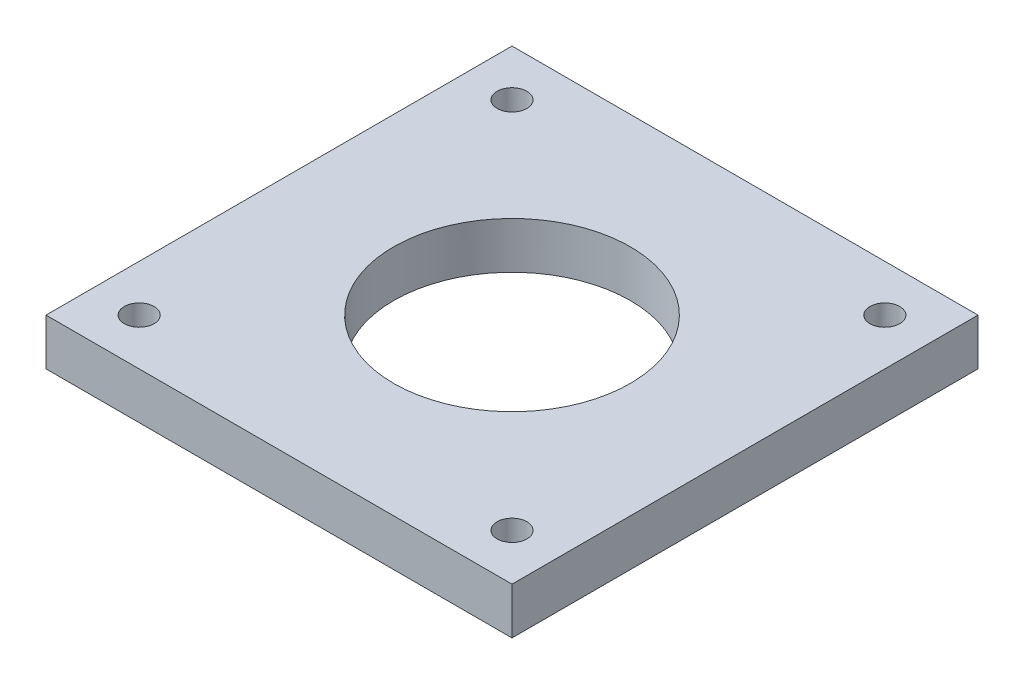
ISO-10303-21;
HEADER;
FILE_DESCRIPTION(('STEP AP214'),'2;1');
FILE_NAME('part.step','',(''),(''),'','','');
FILE_SCHEMA(('AUTOMOTIVE_DESIGN { 1 0 10303 214 1 1 1 1 }'));
ENDSEC;
DATA;
#1=APPLICATION_CONTEXT('core data for automotive mechanical design processes');
#2=APPLICATION_PROTOCOL_DEFINITION('international standard','automotive_design',2000,#1);
#3=PRODUCT_CONTEXT('',#1,'mechanical');
#4=PRODUCT('Part','Part','',(#3));
#5=PRODUCT_RELATED_PRODUCT_CATEGORY('part','',(#4));
#6=PRODUCT_DEFINITION_FORMATION('','',#4);
#7=PRODUCT_DEFINITION_CONTEXT('part definition',#1,'design');
#8=PRODUCT_DEFINITION('design','',#6,#7);
#9=PRODUCT_DEFINITION_SHAPE('','',#8);
#10=(LENGTH_UNIT() NAMED_UNIT(*) SI_UNIT(.MILLI.,.METRE.));
#11=(NAMED_UNIT(*) PLANE_ANGLE_UNIT() SI_UNIT($,.RADIAN.));
#12=(NAMED_UNIT(*) SI_UNIT($,.STERADIAN.) SOLID_ANGLE_UNIT());
#13=UNCERTAINTY_MEASURE_WITH_UNIT(LENGTH_MEASURE(1.E-05),#10,'distance_accuracy_value','');
#14=(GEOMETRIC_REPRESENTATION_CONTEXT(3) GLOBAL_UNCERTAINTY_ASSIGNED_CONTEXT((#13)) GLOBAL_UNIT_ASSIGNED_CONTEXT((#10,
#11,#12)) REPRESENTATION_CONTEXT('',''));
#15=CARTESIAN_POINT('',(0.,0.,0.));
#16=DIRECTION('',(0.,0.,1.));
#17=DIRECTION('',(1.,0.,0.));
#18=AXIS2_PLACEMENT_3D('',#15,#16,#17);
#19=CARTESIAN_POINT('',(25.,5.,25.));
#20=DIRECTION('',(-1.,0.,0.));
#21=DIRECTION('',(0.,0.,1.));
#22=AXIS2_PLACEMENT_3D('',#19,#20,#21);
#23=PLANE('',#22);
#24=DIRECTION('',(0.,0.,-1.));
#25=VECTOR('',#24,1.);
#26=CARTESIAN_POINT('',(25.,0.,25.));
#27=LINE('',#26,#25);
#28=CARTESIAN_POINT('',(25.,0.,25.));
#29=VERTEX_POINT('',#28);
#30=CARTESIAN_POINT('',(25.,0.,-25.));
#31=VERTEX_POINT('',#30);
#32=EDGE_CURVE('E97',#29,#31,#27,.T.);
#33=ORIENTED_EDGE('',*,*,#32,.T.);
#34=DIRECTION('',(0.,-1.,0.));
#35=VECTOR('',#34,1.);
#36=CARTESIAN_POINT('',(25.,5.,-25.));
#37=LINE('',#36,#35);
#38=CARTESIAN_POINT('',(25.,5.,-25.));
#39=VERTEX_POINT('',#38);
#40=EDGE_CURVE('E11',#39,#31,#37,.T.);
#41=ORIENTED_EDGE('',*,*,#40,.F.);
#42=DIRECTION('',(0.,0.,-1.));
#43=VECTOR('',#42,1.);
#44=CARTESIAN_POINT('',(25.,5.,25.));
#45=LINE('',#44,#43);
#46=CARTESIAN_POINT('',(25.,5.,25.));
#47=VERTEX_POINT('',#46);
#48=EDGE_CURVE('E84',#47,#39,#45,.T.);
#49=ORIENTED_EDGE('',*,*,#48,.F.);
#50=DIRECTION('',(0.,-1.,0.));
#51=VECTOR('',#50,1.);
#52=CARTESIAN_POINT('',(25.,5.,25.));
#53=LINE('',#52,#51);
#54=EDGE_CURVE('E93',#47,#29,#53,.T.);
#55=ORIENTED_EDGE('',*,*,#54,.T.);
#56=EDGE_LOOP('',(#33,#41,#49,#55));
#57=FACE_BOUND('',#56,.T.);
#58=ADVANCED_FACE('F31',(#57),#23,.F.);
#59=CARTESIAN_POINT('',(-25.,5.,-25.));
#60=DIRECTION('',(0.,0.,1.));
#61=DIRECTION('',(1.,0.,0.));
#62=AXIS2_PLACEMENT_3D('',#59,#60,#61);
#63=PLANE('',#62);
#64=DIRECTION('',(-1.,0.,0.));
#65=VECTOR('',#64,1.);
#66=CARTESIAN_POINT('',(-25.,0.,-25.));
#67=LINE('',#66,#65);
#68=CARTESIAN_POINT('',(-25.,0.,-25.));
#69=VERTEX_POINT('',#68);
#70=EDGE_CURVE('E88',#31,#69,#67,.T.);
#71=ORIENTED_EDGE('',*,*,#70,.T.);
#72=DIRECTION('',(0.,-1.,0.));
#73=VECTOR('',#72,1.);
#74=CARTESIAN_POINT('',(-25.,5.,-25.));
#75=LINE('',#74,#73);
#76=CARTESIAN_POINT('',(-25.,5.,-25.));
#77=VERTEX_POINT('',#76);
#78=EDGE_CURVE('E40',#77,#69,#75,.T.);
#79=ORIENTED_EDGE('',*,*,#78,.F.);
#80=DIRECTION('',(-1.,0.,0.));
#81=VECTOR('',#80,1.);
#82=CARTESIAN_POINT('',(-25.,5.,-25.));
#83=LINE('',#82,#81);
#84=EDGE_CURVE('E79',#39,#77,#83,.T.);
#85=ORIENTED_EDGE('',*,*,#84,.F.);
#86=ORIENTED_EDGE('',*,*,#40,.T.);
#87=EDGE_LOOP('',(#71,#79,#85,#86));
#88=FACE_BOUND('',#87,.T.);
#89=ADVANCED_FACE('F87',(#88),#63,.F.);
#90=CARTESIAN_POINT('',(-25.,5.,25.));
#91=DIRECTION('',(1.,0.,0.));
#92=DIRECTION('',(0.,0.,-1.));
#93=AXIS2_PLACEMENT_3D('',#90,#91,#92);
#94=PLANE('',#93);
#95=DIRECTION('',(0.,0.,1.));
#96=VECTOR('',#95,1.);
#97=CARTESIAN_POINT('',(-25.,0.,25.));
#98=LINE('',#97,#96);
#99=CARTESIAN_POINT('',(-25.,0.,25.));
#100=VERTEX_POINT('',#99);
#101=EDGE_CURVE('E66',#69,#100,#98,.T.);
#102=ORIENTED_EDGE('',*,*,#101,.T.);
#103=DIRECTION('',(0.,-1.,0.));
#104=VECTOR('',#103,1.);
#105=CARTESIAN_POINT('',(-25.,5.,25.));
#106=LINE('',#105,#104);
#107=CARTESIAN_POINT('',(-25.,5.,25.));
#108=VERTEX_POINT('',#107);
#109=EDGE_CURVE('E89',#108,#100,#106,.T.);
#110=ORIENTED_EDGE('',*,*,#109,.F.);
#111=DIRECTION('',(0.,0.,1.));
#112=VECTOR('',#111,1.);
#113=CARTESIAN_POINT('',(-25.,5.,25.));
#114=LINE('',#113,#112);
#115=EDGE_CURVE('E82',#77,#108,#114,.T.);
#116=ORIENTED_EDGE('',*,*,#115,.F.);
#117=ORIENTED_EDGE('',*,*,#78,.T.);
#118=EDGE_LOOP('',(#102,#110,#116,#117));
#119=FACE_BOUND('',#118,.T.);
#120=ADVANCED_FACE('F91',(#119),#94,.F.);
#121=CARTESIAN_POINT('',(-25.,5.,25.));
#122=DIRECTION('',(0.,0.,-1.));
#123=DIRECTION('',(-1.,0.,0.));
#124=AXIS2_PLACEMENT_3D('',#121,#122,#123);
#125=PLANE('',#124);
#126=DIRECTION('',(1.,0.,0.));
#127=VECTOR('',#126,1.);
#128=CARTESIAN_POINT('',(-25.,0.,25.));
#129=LINE('',#128,#127);
#130=EDGE_CURVE('E72',#100,#29,#129,.T.);
#131=ORIENTED_EDGE('',*,*,#130,.T.);
#132=ORIENTED_EDGE('',*,*,#54,.F.);
#133=DIRECTION('',(1.,0.,0.));
#134=VECTOR('',#133,1.);
#135=CARTESIAN_POINT('',(-25.,5.,25.));
#136=LINE('',#135,#134);
#137=EDGE_CURVE('E49',#108,#47,#136,.T.);
#138=ORIENTED_EDGE('',*,*,#137,.F.);
#139=ORIENTED_EDGE('',*,*,#109,.T.);
#140=EDGE_LOOP('',(#131,#132,#138,#139));
#141=FACE_BOUND('',#140,.T.);
#142=ADVANCED_FACE('F140',(#141),#125,.F.);
#143=CARTESIAN_POINT('',(25.,5.,-25.));
#144=DIRECTION('',(0.,-1.,0.));
#145=DIRECTION('',(0.,0.,-1.));
#146=AXIS2_PLACEMENT_3D('',#143,#144,#145);
#147=PLANE('',#146);
#148=CARTESIAN_POINT('',(0.,5.,0.));
#149=DIRECTION('',(0.,1.,0.));
#150=DIRECTION('',(0.,0.,1.));
#151=AXIS2_PLACEMENT_3D('',#148,#149,#150);
#152=CIRCLE('',#151,12.7);
#153=CARTESIAN_POINT('',(0.,5.,12.7));
#154=VERTEX_POINT('',#153);
#155=EDGE_CURVE('E128',#154,#154,#152,.T.);
#156=ORIENTED_EDGE('',*,*,#155,.F.);
#157=EDGE_LOOP('',(#156));
#158=FACE_BOUND('',#157,.T.);
#159=CARTESIAN_POINT('',(20.,5.,-20.));
#160=DIRECTION('',(0.,1.,0.));
#161=DIRECTION('',(0.,0.,1.));
#162=AXIS2_PLACEMENT_3D('',#159,#160,#161);
#163=CIRCLE('',#162,1.6);
#164=CARTESIAN_POINT('',(20.,5.,-18.4));
#165=VERTEX_POINT('',#164);
#166=EDGE_CURVE('E118',#165,#165,#163,.T.);
#167=ORIENTED_EDGE('',*,*,#166,.F.);
#168=EDGE_LOOP('',(#167));
#169=FACE_BOUND('',#168,.T.);
#170=CARTESIAN_POINT('',(-20.,5.,-20.));
#171=DIRECTION('',(0.,1.,0.));
#172=DIRECTION('',(0.,0.,1.));
#173=AXIS2_PLACEMENT_3D('',#170,#171,#172);
#174=CIRCLE('',#173,1.6);
#175=CARTESIAN_POINT('',(-20.,5.,-18.4));
#176=VERTEX_POINT('',#175);
#177=EDGE_CURVE('E115',#176,#176,#174,.T.);
#178=ORIENTED_EDGE('',*,*,#177,.F.);
#179=EDGE_LOOP('',(#178));
#180=FACE_BOUND('',#179,.T.);
#181=CARTESIAN_POINT('',(20.,5.,20.));
#182=DIRECTION('',(0.,1.,0.));
#183=DIRECTION('',(0.,0.,1.));
#184=AXIS2_PLACEMENT_3D('',#181,#182,#183);
#185=CIRCLE('',#184,1.6);
#186=CARTESIAN_POINT('',(20.,5.,21.6));
#187=VERTEX_POINT('',#186);
#188=EDGE_CURVE('E112',#187,#187,#185,.T.);
#189=ORIENTED_EDGE('',*,*,#188,.F.);
#190=EDGE_LOOP('',(#189));
#191=FACE_BOUND('',#190,.T.);
#192=CARTESIAN_POINT('',(-20.,5.,20.));
#193=DIRECTION('',(0.,1.,0.));
#194=DIRECTION('',(0.,0.,1.));
#195=AXIS2_PLACEMENT_3D('',#192,#193,#194);
#196=CIRCLE('',#195,1.6);
#197=CARTESIAN_POINT('',(-20.,5.,21.6));
#198=VERTEX_POINT('',#197);
#199=EDGE_CURVE('E108',#198,#198,#196,.T.);
#200=ORIENTED_EDGE('',*,*,#199,.F.);
#201=EDGE_LOOP('',(#200));
#202=FACE_BOUND('',#201,.T.);
#203=ORIENTED_EDGE('',*,*,#48,.T.);
#204=ORIENTED_EDGE('',*,*,#84,.T.);
#205=ORIENTED_EDGE('',*,*,#115,.T.);
#206=ORIENTED_EDGE('',*,*,#137,.T.);
#207=EDGE_LOOP('',(#203,#204,#205,#206));
#208=FACE_BOUND('',#207,.T.);
#209=ADVANCED_FACE('F80',(#158,#169,#180,#191,#202,#208),#147,.F.);
#210=CARTESIAN_POINT('',(25.,0.,-25.));
#211=DIRECTION('',(0.,-1.,0.));
#212=DIRECTION('',(0.,0.,-1.));
#213=AXIS2_PLACEMENT_3D('',#210,#211,#212);
#214=PLANE('',#213);
#215=CARTESIAN_POINT('',(0.,0.,0.));
#216=DIRECTION('',(0.,-1.,0.));
#217=DIRECTION('',(0.,0.,-1.));
#218=AXIS2_PLACEMENT_3D('',#215,#216,#217);
#219=CIRCLE('',#218,12.7);
#220=CARTESIAN_POINT('',(0.,0.,-12.7));
#221=VERTEX_POINT('',#220);
#222=EDGE_CURVE('E34',#221,#221,#219,.T.);
#223=ORIENTED_EDGE('',*,*,#222,.F.);
#224=EDGE_LOOP('',(#223));
#225=FACE_BOUND('',#224,.T.);
#226=CARTESIAN_POINT('',(20.,0.,-20.));
#227=DIRECTION('',(0.,-1.,0.));
#228=DIRECTION('',(0.,0.,-1.));
#229=AXIS2_PLACEMENT_3D('',#226,#227,#228);
#230=CIRCLE('',#229,1.6);
#231=CARTESIAN_POINT('',(20.,0.,-21.6));
#232=VERTEX_POINT('',#231);
#233=EDGE_CURVE('E116',#232,#232,#230,.T.);
#234=ORIENTED_EDGE('',*,*,#233,.F.);
#235=EDGE_LOOP('',(#234));
#236=FACE_BOUND('',#235,.T.);
#237=CARTESIAN_POINT('',(-20.,0.,-20.));
#238=DIRECTION('',(0.,-1.,0.));
#239=DIRECTION('',(0.,0.,-1.));
#240=AXIS2_PLACEMENT_3D('',#237,#238,#239);
#241=CIRCLE('',#240,1.6);
#242=CARTESIAN_POINT('',(-20.,0.,-21.6));
#243=VERTEX_POINT('',#242);
#244=EDGE_CURVE('E113',#243,#243,#241,.T.);
#245=ORIENTED_EDGE('',*,*,#244,.F.);
#246=EDGE_LOOP('',(#245));
#247=FACE_BOUND('',#246,.T.);
#248=CARTESIAN_POINT('',(20.,0.,20.));
#249=DIRECTION('',(0.,-1.,0.));
#250=DIRECTION('',(0.,0.,-1.));
#251=AXIS2_PLACEMENT_3D('',#248,#249,#250);
#252=CIRCLE('',#251,1.6);
#253=CARTESIAN_POINT('',(20.,0.,18.4));
#254=VERTEX_POINT('',#253);
#255=EDGE_CURVE('E109',#254,#254,#252,.T.);
#256=ORIENTED_EDGE('',*,*,#255,.F.);
#257=EDGE_LOOP('',(#256));
#258=FACE_BOUND('',#257,.T.);
#259=CARTESIAN_POINT('',(-20.,0.,20.));
#260=DIRECTION('',(0.,-1.,0.));
#261=DIRECTION('',(0.,0.,-1.));
#262=AXIS2_PLACEMENT_3D('',#259,#260,#261);
#263=CIRCLE('',#262,1.6);
#264=CARTESIAN_POINT('',(-20.,0.,18.4));
#265=VERTEX_POINT('',#264);
#266=EDGE_CURVE('E100',#265,#265,#263,.T.);
#267=ORIENTED_EDGE('',*,*,#266,.F.);
#268=EDGE_LOOP('',(#267));
#269=FACE_BOUND('',#268,.T.);
#270=ORIENTED_EDGE('',*,*,#32,.F.);
#271=ORIENTED_EDGE('',*,*,#130,.F.);
#272=ORIENTED_EDGE('',*,*,#101,.F.);
#273=ORIENTED_EDGE('',*,*,#70,.F.);
#274=EDGE_LOOP('',(#270,#271,#272,#273));
#275=FACE_BOUND('',#274,.T.);
#276=ADVANCED_FACE('F139',(#225,#236,#247,#258,#269,#275),#214,.T.);
#277=CARTESIAN_POINT('',(-20.,5.,20.));
#278=DIRECTION('',(0.,1.,0.));
#279=DIRECTION('',(0.,0.,1.));
#280=AXIS2_PLACEMENT_3D('',#277,#278,#279);
#281=CYLINDRICAL_SURFACE('',#280,1.6);
#282=ORIENTED_EDGE('',*,*,#266,.T.);
#283=EDGE_LOOP('',(#282));
#284=FACE_BOUND('',#283,.T.);
#285=ORIENTED_EDGE('',*,*,#199,.T.);
#286=EDGE_LOOP('',(#285));
#287=FACE_BOUND('',#286,.T.);
#288=ADVANCED_FACE('F136',(#284,#287),#281,.F.);
#289=CARTESIAN_POINT('',(20.,5.,20.));
#290=DIRECTION('',(0.,1.,0.));
#291=DIRECTION('',(0.,0.,1.));
#292=AXIS2_PLACEMENT_3D('',#289,#290,#291);
#293=CYLINDRICAL_SURFACE('',#292,1.6);
#294=ORIENTED_EDGE('',*,*,#255,.T.);
#295=EDGE_LOOP('',(#294));
#296=FACE_BOUND('',#295,.T.);
#297=ORIENTED_EDGE('',*,*,#188,.T.);
#298=EDGE_LOOP('',(#297));
#299=FACE_BOUND('',#298,.T.);
#300=ADVANCED_FACE('F180',(#296,#299),#293,.F.);
#301=CARTESIAN_POINT('',(-20.,5.,-20.));
#302=DIRECTION('',(0.,1.,0.));
#303=DIRECTION('',(0.,0.,1.));
#304=AXIS2_PLACEMENT_3D('',#301,#302,#303);
#305=CYLINDRICAL_SURFACE('',#304,1.6);
#306=ORIENTED_EDGE('',*,*,#244,.T.);
#307=EDGE_LOOP('',(#306));
#308=FACE_BOUND('',#307,.T.);
#309=ORIENTED_EDGE('',*,*,#177,.T.);
#310=EDGE_LOOP('',(#309));
#311=FACE_BOUND('',#310,.T.);
#312=ADVANCED_FACE('F190',(#308,#311),#305,.F.);
#313=CARTESIAN_POINT('',(20.,5.,-20.));
#314=DIRECTION('',(0.,1.,0.));
#315=DIRECTION('',(0.,0.,1.));
#316=AXIS2_PLACEMENT_3D('',#313,#314,#315);
#317=CYLINDRICAL_SURFACE('',#316,1.6);
#318=ORIENTED_EDGE('',*,*,#233,.T.);
#319=EDGE_LOOP('',(#318));
#320=FACE_BOUND('',#319,.T.);
#321=ORIENTED_EDGE('',*,*,#166,.T.);
#322=EDGE_LOOP('',(#321));
#323=FACE_BOUND('',#322,.T.);
#324=ADVANCED_FACE('F200',(#320,#323),#317,.F.);
#325=CARTESIAN_POINT('',(0.,5.,0.));
#326=DIRECTION('',(0.,1.,0.));
#327=DIRECTION('',(0.,0.,1.));
#328=AXIS2_PLACEMENT_3D('',#325,#326,#327);
#329=CYLINDRICAL_SURFACE('',#328,12.7);
#330=ORIENTED_EDGE('',*,*,#222,.T.);
#331=EDGE_LOOP('',(#330));
#332=FACE_BOUND('',#331,.T.);
#333=ORIENTED_EDGE('',*,*,#155,.T.);
#334=EDGE_LOOP('',(#333));
#335=FACE_BOUND('',#334,.T.);
#336=ADVANCED_FACE('F209',(#332,#335),#329,.F.);
#337=CLOSED_SHELL('',(#58,#89,#120,#142,#209,#276,#288,#300,#312,#324,#336));
#338=MANIFOLD_SOLID_BREP('B2',#337);
#339=ADVANCED_BREP_SHAPE_REPRESENTATION('',(#18,#338),#14);
#340=SHAPE_DEFINITION_REPRESENTATION(#9,#339);
ENDSEC;
END-ISO-10303-21;
